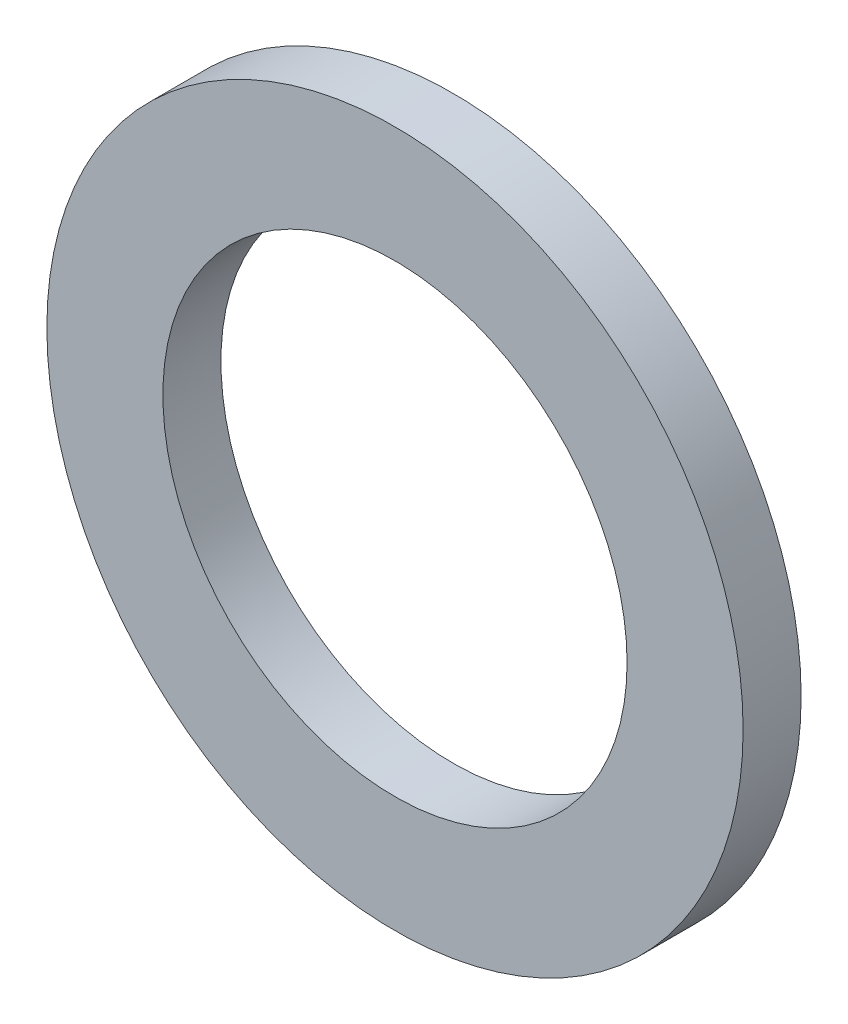
ISO-10303-21;
HEADER;
FILE_DESCRIPTION(('STEP AP214'),'2;1');
FILE_NAME('part.step','',(''),(''),'','','');
FILE_SCHEMA(('AUTOMOTIVE_DESIGN { 1 0 10303 214 1 1 1 1 }'));
ENDSEC;
DATA;
#1=APPLICATION_CONTEXT('core data for automotive mechanical design processes');
#2=APPLICATION_PROTOCOL_DEFINITION('international standard','automotive_design',2000,#1);
#3=PRODUCT_CONTEXT('',#1,'mechanical');
#4=PRODUCT('Part','Part','',(#3));
#5=PRODUCT_RELATED_PRODUCT_CATEGORY('part','',(#4));
#6=PRODUCT_DEFINITION_FORMATION('','',#4);
#7=PRODUCT_DEFINITION_CONTEXT('part definition',#1,'design');
#8=PRODUCT_DEFINITION('design','',#6,#7);
#9=PRODUCT_DEFINITION_SHAPE('','',#8);
#10=(LENGTH_UNIT() NAMED_UNIT(*) SI_UNIT(.MILLI.,.METRE.));
#11=(NAMED_UNIT(*) PLANE_ANGLE_UNIT() SI_UNIT($,.RADIAN.));
#12=(NAMED_UNIT(*) SI_UNIT($,.STERADIAN.) SOLID_ANGLE_UNIT());
#13=UNCERTAINTY_MEASURE_WITH_UNIT(LENGTH_MEASURE(1.E-05),#10,'distance_accuracy_value','');
#14=(GEOMETRIC_REPRESENTATION_CONTEXT(3) GLOBAL_UNCERTAINTY_ASSIGNED_CONTEXT((#13)) GLOBAL_UNIT_ASSIGNED_CONTEXT((#10,
#11,#12)) REPRESENTATION_CONTEXT('',''));
#15=CARTESIAN_POINT('',(0.,0.,0.));
#16=DIRECTION('',(0.,0.,1.));
#17=DIRECTION('',(1.,0.,0.));
#18=AXIS2_PLACEMENT_3D('',#15,#16,#17);
#19=CARTESIAN_POINT('',(0.,0.,3.175));
#20=DIRECTION('',(0.,0.,1.));
#21=DIRECTION('',(1.,0.,0.));
#22=AXIS2_PLACEMENT_3D('',#19,#20,#21);
#23=PLANE('',#22);
#24=CARTESIAN_POINT('',(0.,0.,3.175));
#25=DIRECTION('',(0.,0.,1.));
#26=DIRECTION('',(1.,0.,0.));
#27=AXIS2_PLACEMENT_3D('',#24,#25,#26);
#28=CIRCLE('',#27,19.05);
#29=CARTESIAN_POINT('',(19.05,0.,3.175));
#30=VERTEX_POINT('',#29);
#31=EDGE_CURVE('E10',#30,#30,#28,.T.);
#32=ORIENTED_EDGE('',*,*,#31,.T.);
#33=EDGE_LOOP('',(#32));
#34=FACE_BOUND('',#33,.T.);
#35=CARTESIAN_POINT('',(0.,0.,3.175));
#36=DIRECTION('',(0.,0.,1.));
#37=DIRECTION('',(1.,0.,0.));
#38=AXIS2_PLACEMENT_3D('',#35,#36,#37);
#39=CIRCLE('',#38,12.7);
#40=CARTESIAN_POINT('',(12.7,0.,3.175));
#41=VERTEX_POINT('',#40);
#42=EDGE_CURVE('E50',#41,#41,#39,.T.);
#43=ORIENTED_EDGE('',*,*,#42,.F.);
#44=EDGE_LOOP('',(#43));
#45=FACE_BOUND('',#44,.T.);
#46=ADVANCED_FACE('F37',(#34,#45),#23,.T.);
#47=CARTESIAN_POINT('',(0.,0.,0.));
#48=DIRECTION('',(0.,0.,1.));
#49=DIRECTION('',(1.,0.,0.));
#50=AXIS2_PLACEMENT_3D('',#47,#48,#49);
#51=PLANE('',#50);
#52=CARTESIAN_POINT('',(0.,0.,0.));
#53=DIRECTION('',(0.,0.,1.));
#54=DIRECTION('',(1.,0.,0.));
#55=AXIS2_PLACEMENT_3D('',#52,#53,#54);
#56=CIRCLE('',#55,19.05);
#57=CARTESIAN_POINT('',(19.05,0.,0.));
#58=VERTEX_POINT('',#57);
#59=EDGE_CURVE('E41',#58,#58,#56,.T.);
#60=ORIENTED_EDGE('',*,*,#59,.F.);
#61=EDGE_LOOP('',(#60));
#62=FACE_BOUND('',#61,.T.);
#63=CARTESIAN_POINT('',(0.,0.,0.));
#64=DIRECTION('',(0.,0.,1.));
#65=DIRECTION('',(1.,0.,0.));
#66=AXIS2_PLACEMENT_3D('',#63,#64,#65);
#67=CIRCLE('',#66,12.7);
#68=CARTESIAN_POINT('',(12.7,0.,0.));
#69=VERTEX_POINT('',#68);
#70=EDGE_CURVE('E52',#69,#69,#67,.T.);
#71=ORIENTED_EDGE('',*,*,#70,.T.);
#72=EDGE_LOOP('',(#71));
#73=FACE_BOUND('',#72,.T.);
#74=ADVANCED_FACE('F64',(#62,#73),#51,.F.);
#75=CARTESIAN_POINT('',(0.,0.,3.175));
#76=DIRECTION('',(0.,0.,-1.));
#77=DIRECTION('',(-1.,0.,0.));
#78=AXIS2_PLACEMENT_3D('',#75,#76,#77);
#79=CYLINDRICAL_SURFACE('',#78,19.05);
#80=ORIENTED_EDGE('',*,*,#31,.F.);
#81=EDGE_LOOP('',(#80));
#82=FACE_BOUND('',#81,.T.);
#83=ORIENTED_EDGE('',*,*,#59,.T.);
#84=EDGE_LOOP('',(#83));
#85=FACE_BOUND('',#84,.T.);
#86=ADVANCED_FACE('F39',(#82,#85),#79,.T.);
#87=CARTESIAN_POINT('',(0.,0.,3.175));
#88=DIRECTION('',(0.,0.,-1.));
#89=DIRECTION('',(-1.,0.,0.));
#90=AXIS2_PLACEMENT_3D('',#87,#88,#89);
#91=CYLINDRICAL_SURFACE('',#90,12.7);
#92=ORIENTED_EDGE('',*,*,#42,.T.);
#93=EDGE_LOOP('',(#92));
#94=FACE_BOUND('',#93,.T.);
#95=ORIENTED_EDGE('',*,*,#70,.F.);
#96=EDGE_LOOP('',(#95));
#97=FACE_BOUND('',#96,.T.);
#98=ADVANCED_FACE('F60',(#94,#97),#91,.F.);
#99=CLOSED_SHELL('',(#46,#74,#86,#98));
#100=MANIFOLD_SOLID_BREP('B2',#99);
#101=ADVANCED_BREP_SHAPE_REPRESENTATION('',(#18,#100),#14);
#102=SHAPE_DEFINITION_REPRESENTATION(#9,#101);
ENDSEC;
END-ISO-10303-21;
